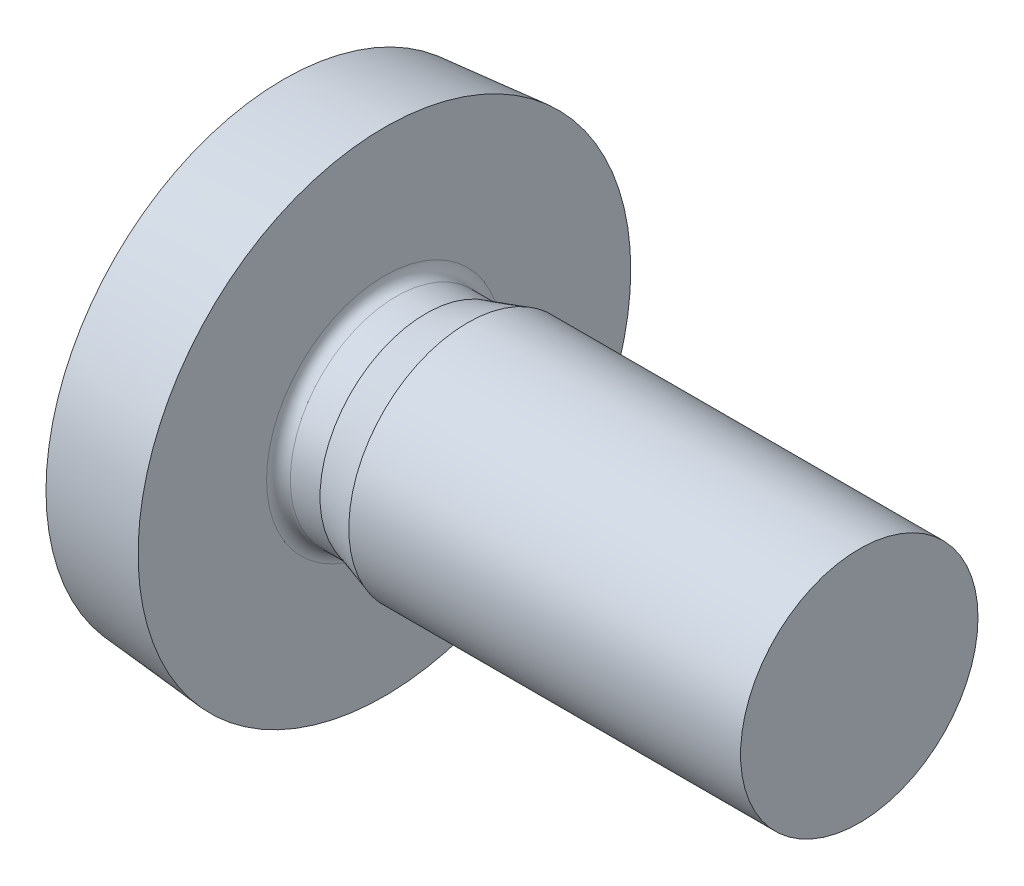
ISO-10303-21;
HEADER;
FILE_DESCRIPTION(('STEP AP214'),'2;1');
FILE_NAME('part.step','',(''),(''),'','','');
FILE_SCHEMA(('AUTOMOTIVE_DESIGN { 1 0 10303 214 1 1 1 1 }'));
ENDSEC;
DATA;
#1=APPLICATION_CONTEXT('core data for automotive mechanical design processes');
#2=APPLICATION_PROTOCOL_DEFINITION('international standard','automotive_design',2000,#1);
#3=PRODUCT_CONTEXT('',#1,'mechanical');
#4=PRODUCT('Part','Part','',(#3));
#5=PRODUCT_RELATED_PRODUCT_CATEGORY('part','',(#4));
#6=PRODUCT_DEFINITION_FORMATION('','',#4);
#7=PRODUCT_DEFINITION_CONTEXT('part definition',#1,'design');
#8=PRODUCT_DEFINITION('design','',#6,#7);
#9=PRODUCT_DEFINITION_SHAPE('','',#8);
#10=(LENGTH_UNIT() NAMED_UNIT(*) SI_UNIT(.MILLI.,.METRE.));
#11=(NAMED_UNIT(*) PLANE_ANGLE_UNIT() SI_UNIT($,.RADIAN.));
#12=(NAMED_UNIT(*) SI_UNIT($,.STERADIAN.) SOLID_ANGLE_UNIT());
#13=UNCERTAINTY_MEASURE_WITH_UNIT(LENGTH_MEASURE(1.E-05),#10,'distance_accuracy_value','');
#14=(GEOMETRIC_REPRESENTATION_CONTEXT(3) GLOBAL_UNCERTAINTY_ASSIGNED_CONTEXT((#13)) GLOBAL_UNIT_ASSIGNED_CONTEXT((#10,
#11,#12)) REPRESENTATION_CONTEXT('',''));
#15=CARTESIAN_POINT('',(0.,0.,0.));
#16=DIRECTION('',(0.,0.,1.));
#17=DIRECTION('',(1.,0.,0.));
#18=AXIS2_PLACEMENT_3D('',#15,#16,#17);
#19=CARTESIAN_POINT('',(8.,0.999999999999991,0.));
#20=DIRECTION('',(1.,0.,0.));
#21=DIRECTION('',(0.,0.,-1.));
#22=AXIS2_PLACEMENT_3D('',#19,#20,#21);
#23=PLANE('',#22);
#24=CARTESIAN_POINT('',(8.,0.,0.));
#25=DIRECTION('',(1.,0.,0.));
#26=DIRECTION('',(0.,0.,-1.));
#27=AXIS2_PLACEMENT_3D('',#24,#25,#26);
#28=CIRCLE('',#27,2.);
#29=CARTESIAN_POINT('',(8.,0.,-2.));
#30=VERTEX_POINT('',#29);
#31=EDGE_CURVE('E187',#30,#30,#28,.F.);
#32=ORIENTED_EDGE('',*,*,#31,.F.);
#33=EDGE_LOOP('',(#32));
#34=FACE_BOUND('',#33,.T.);
#35=ADVANCED_FACE('F17',(#34),#23,.T.);
#36=CARTESIAN_POINT('',(-1.25,0.,0.));
#37=DIRECTION('',(1.,0.,0.));
#38=DIRECTION('',(0.,0.,-1.));
#39=AXIS2_PLACEMENT_3D('',#36,#37,#38);
#40=PLANE('',#39);
#41=CARTESIAN_POINT('',(-1.25,1.38333333333333,1.38333333333332));
#42=DIRECTION('',(-1.,0.,0.));
#43=DIRECTION('',(0.,0.,1.));
#44=AXIS2_PLACEMENT_3D('',#41,#42,#43);
#45=CIRCLE('',#44,0.83);
#46=CARTESIAN_POINT('',(-1.25,1.38333333333333,0.553333333333322));
#47=VERTEX_POINT('',#46);
#48=CARTESIAN_POINT('',(-1.25,0.553333333333333,1.38333333333332));
#49=VERTEX_POINT('',#48);
#50=EDGE_CURVE('E219',#47,#49,#45,.T.);
#51=ORIENTED_EDGE('',*,*,#50,.F.);
#52=DIRECTION('',(0.,-1.,0.));
#53=VECTOR('',#52,1.);
#54=CARTESIAN_POINT('',(-1.25,1.38333333333333,0.553333333333322));
#55=LINE('',#54,#53);
#56=CARTESIAN_POINT('',(-1.25,2.15,0.553333333333322));
#57=VERTEX_POINT('',#56);
#58=EDGE_CURVE('E222',#47,#57,#55,.F.);
#59=ORIENTED_EDGE('',*,*,#58,.T.);
#60=DIRECTION('',(0.,0.,1.));
#61=VECTOR('',#60,1.);
#62=CARTESIAN_POINT('',(-1.25,2.15,0.553333333333322));
#63=LINE('',#62,#61);
#64=CARTESIAN_POINT('',(-1.25,2.15,-0.55333333333335));
#65=VERTEX_POINT('',#64);
#66=EDGE_CURVE('E146',#57,#65,#63,.F.);
#67=ORIENTED_EDGE('',*,*,#66,.T.);
#68=DIRECTION('',(0.,1.,0.));
#69=VECTOR('',#68,1.);
#70=CARTESIAN_POINT('',(-1.25,2.15,-0.55333333333335));
#71=LINE('',#70,#69);
#72=CARTESIAN_POINT('',(-1.25,1.38333333333333,-0.55333333333335));
#73=VERTEX_POINT('',#72);
#74=EDGE_CURVE('E139',#65,#73,#71,.F.);
#75=ORIENTED_EDGE('',*,*,#74,.T.);
#76=CARTESIAN_POINT('',(-1.25,1.38333333333333,-1.38333333333335));
#77=DIRECTION('',(-1.,0.,0.));
#78=DIRECTION('',(0.,0.,1.));
#79=AXIS2_PLACEMENT_3D('',#76,#77,#78);
#80=CIRCLE('',#79,0.83);
#81=CARTESIAN_POINT('',(-1.25,0.553333333333331,-1.38333333333335));
#82=VERTEX_POINT('',#81);
#83=EDGE_CURVE('E143',#82,#73,#80,.T.);
#84=ORIENTED_EDGE('',*,*,#83,.F.);
#85=DIRECTION('',(0.,0.,1.));
#86=VECTOR('',#85,1.);
#87=CARTESIAN_POINT('',(-1.25,0.553333333333333,-1.38333333333335));
#88=LINE('',#87,#86);
#89=CARTESIAN_POINT('',(-1.25,0.553333333333333,-2.15000000000001));
#90=VERTEX_POINT('',#89);
#91=EDGE_CURVE('E134',#82,#90,#88,.F.);
#92=ORIENTED_EDGE('',*,*,#91,.T.);
#93=DIRECTION('',(0.,1.,0.));
#94=VECTOR('',#93,1.);
#95=CARTESIAN_POINT('',(-1.25,0.553333333333333,-2.15000000000001));
#96=LINE('',#95,#94);
#97=CARTESIAN_POINT('',(-1.25,-0.553333333333334,-2.15000000000001));
#98=VERTEX_POINT('',#97);
#99=EDGE_CURVE('E181',#90,#98,#96,.F.);
#100=ORIENTED_EDGE('',*,*,#99,.T.);
#101=DIRECTION('',(0.,0.,-1.));
#102=VECTOR('',#101,1.);
#103=CARTESIAN_POINT('',(-1.25,-0.553333333333334,-2.15000000000001));
#104=LINE('',#103,#102);
#105=CARTESIAN_POINT('',(-1.25,-0.553333333333333,-1.38333333333335));
#106=VERTEX_POINT('',#105);
#107=EDGE_CURVE('E175',#98,#106,#104,.F.);
#108=ORIENTED_EDGE('',*,*,#107,.T.);
#109=CARTESIAN_POINT('',(-1.25,-1.38333333333333,-1.38333333333335));
#110=DIRECTION('',(-1.,0.,0.));
#111=DIRECTION('',(0.,0.,1.));
#112=AXIS2_PLACEMENT_3D('',#109,#110,#111);
#113=CIRCLE('',#112,0.83);
#114=CARTESIAN_POINT('',(-1.25,-1.38333333333333,-0.55333333333335));
#115=VERTEX_POINT('',#114);
#116=EDGE_CURVE('E178',#115,#106,#113,.T.);
#117=ORIENTED_EDGE('',*,*,#116,.F.);
#118=DIRECTION('',(0.,1.,0.));
#119=VECTOR('',#118,1.);
#120=CARTESIAN_POINT('',(-1.25,-1.38333333333333,-0.55333333333335));
#121=LINE('',#120,#119);
#122=CARTESIAN_POINT('',(-1.25,-2.15,-0.55333333333335));
#123=VERTEX_POINT('',#122);
#124=EDGE_CURVE('E190',#115,#123,#121,.F.);
#125=ORIENTED_EDGE('',*,*,#124,.T.);
#126=DIRECTION('',(0.,0.,-1.));
#127=VECTOR('',#126,1.);
#128=CARTESIAN_POINT('',(-1.25,-2.15,-0.55333333333335));
#129=LINE('',#128,#127);
#130=CARTESIAN_POINT('',(-1.25,-2.15,0.553333333333322));
#131=VERTEX_POINT('',#130);
#132=EDGE_CURVE('E196',#123,#131,#129,.F.);
#133=ORIENTED_EDGE('',*,*,#132,.T.);
#134=DIRECTION('',(0.,1.,0.));
#135=VECTOR('',#134,1.);
#136=CARTESIAN_POINT('',(-1.25,-2.15,0.553333333333322));
#137=LINE('',#136,#135);
#138=CARTESIAN_POINT('',(-1.25,-1.38333333333333,0.553333333333322));
#139=VERTEX_POINT('',#138);
#140=EDGE_CURVE('E201',#131,#139,#137,.T.);
#141=ORIENTED_EDGE('',*,*,#140,.T.);
#142=CARTESIAN_POINT('',(-1.25,-1.38333333333333,1.38333333333332));
#143=DIRECTION('',(-1.,0.,0.));
#144=DIRECTION('',(0.,0.,1.));
#145=AXIS2_PLACEMENT_3D('',#142,#143,#144);
#146=CIRCLE('',#145,0.829999999999999);
#147=CARTESIAN_POINT('',(-1.25,-0.553333333333332,1.38333333333332));
#148=VERTEX_POINT('',#147);
#149=EDGE_CURVE('E203',#148,#139,#146,.T.);
#150=ORIENTED_EDGE('',*,*,#149,.F.);
#151=DIRECTION('',(0.,0.,-1.));
#152=VECTOR('',#151,1.);
#153=CARTESIAN_POINT('',(-1.25,-0.553333333333333,1.38333333333332));
#154=LINE('',#153,#152);
#155=CARTESIAN_POINT('',(-1.25,-0.553333333333334,2.15000000000001));
#156=VERTEX_POINT('',#155);
#157=EDGE_CURVE('E206',#148,#156,#154,.F.);
#158=ORIENTED_EDGE('',*,*,#157,.T.);
#159=DIRECTION('',(0.,1.,0.));
#160=VECTOR('',#159,1.);
#161=CARTESIAN_POINT('',(-1.25,-0.553333333333334,2.15000000000001));
#162=LINE('',#161,#160);
#163=CARTESIAN_POINT('',(-1.25,0.553333333333333,2.15000000000001));
#164=VERTEX_POINT('',#163);
#165=EDGE_CURVE('E212',#156,#164,#162,.T.);
#166=ORIENTED_EDGE('',*,*,#165,.T.);
#167=DIRECTION('',(0.,0.,1.));
#168=VECTOR('',#167,1.);
#169=CARTESIAN_POINT('',(-1.25,0.553333333333333,2.15000000000001));
#170=LINE('',#169,#168);
#171=EDGE_CURVE('E217',#164,#49,#170,.F.);
#172=ORIENTED_EDGE('',*,*,#171,.T.);
#173=EDGE_LOOP('',(#51,#59,#67,#75,#84,#92,#100,#108,#117,#125,#133,#141,#150,#158,#166,#172));
#174=FACE_BOUND('',#173,.T.);
#175=ADVANCED_FACE('F142',(#174),#40,.F.);
#176=CARTESIAN_POINT('',(4.7,0.,0.));
#177=DIRECTION('',(1.,0.,0.));
#178=DIRECTION('',(0.,0.,-1.));
#179=AXIS2_PLACEMENT_3D('',#176,#177,#178);
#180=CYLINDRICAL_SURFACE('',#179,2.);
#181=CARTESIAN_POINT('',(1.39999999993279,0.,0.));
#182=DIRECTION('',(1.,0.,0.));
#183=DIRECTION('',(0.,1.,0.));
#184=AXIS2_PLACEMENT_3D('',#181,#182,#183);
#185=CIRCLE('',#184,2.00000000000955);
#186=CARTESIAN_POINT('',(1.39999999993279,2.00000000000955,0.));
#187=VERTEX_POINT('',#186);
#188=EDGE_CURVE('E170',#187,#187,#185,.F.);
#189=ORIENTED_EDGE('',*,*,#188,.F.);
#190=EDGE_LOOP('',(#189));
#191=FACE_BOUND('',#190,.T.);
#192=ORIENTED_EDGE('',*,*,#31,.T.);
#193=EDGE_LOOP('',(#192));
#194=FACE_BOUND('',#193,.T.);
#195=ADVANCED_FACE('F345',(#191,#194),#180,.T.);
#196=CARTESIAN_POINT('',(-2.5,0.553333333333333,-1.38333333333335));
#197=DIRECTION('',(0.,1.,0.));
#198=DIRECTION('',(0.,0.,1.));
#199=AXIS2_PLACEMENT_3D('',#196,#197,#198);
#200=PLANE('',#199);
#201=DIRECTION('',(-1.,0.,0.));
#202=VECTOR('',#201,1.);
#203=CARTESIAN_POINT('',(-2.5,0.553333333333333,-2.15000000000001));
#204=LINE('',#203,#202);
#205=CARTESIAN_POINT('',(-2.26043126464438,0.553333333333333,-2.15000000000001));
#206=VERTEX_POINT('',#205);
#207=EDGE_CURVE('E183',#206,#90,#204,.F.);
#208=ORIENTED_EDGE('',*,*,#207,.T.);
#209=ORIENTED_EDGE('',*,*,#91,.F.);
#210=DIRECTION('',(-1.,0.,0.));
#211=VECTOR('',#210,1.);
#212=CARTESIAN_POINT('',(-2.5,0.55333333333333,-1.38333333333335));
#213=LINE('',#212,#211);
#214=CARTESIAN_POINT('',(-2.39279223948006,0.553333333333331,-1.38333333333335));
#215=VERTEX_POINT('',#214);
#216=EDGE_CURVE('E156',#215,#82,#213,.F.);
#217=ORIENTED_EDGE('',*,*,#216,.F.);
#218=CARTESIAN_POINT('',(-2.2604312646444,0.553333333333332,-2.15000000000001));
#219=CARTESIAN_POINT('',(-2.28727638804803,0.553333333333333,-2.02304832060491));
#220=CARTESIAN_POINT('',(-2.31172903098615,0.553333333333333,-1.89568359201846));
#221=CARTESIAN_POINT('',(-2.35584935593138,0.553333333333333,-1.64012803646291));
#222=CARTESIAN_POINT('',(-2.37551703793848,0.553333333333333,-1.5119372094938));
#223=CARTESIAN_POINT('',(-2.39279223948008,0.553333333333333,-1.38333333333335));
#224=B_SPLINE_CURVE_WITH_KNOTS('',3,(#218,#219,#220,#221,#222,#223),.UNSPECIFIED.,.F.,.F.,(4,2,
4),(0.,0.38907242579116,0.77814485158232),.UNSPECIFIED.);
#225=EDGE_CURVE('E173',#206,#215,#224,.T.);
#226=ORIENTED_EDGE('',*,*,#225,.F.);
#227=EDGE_LOOP('',(#208,#209,#217,#226));
#228=FACE_BOUND('',#227,.T.);
#229=ADVANCED_FACE('F341',(#228),#200,.F.);
#230=CARTESIAN_POINT('',(-2.5,1.38333333333333,-1.38333333333335));
#231=DIRECTION('',(-1.,0.,0.));
#232=DIRECTION('',(0.,0.,1.));
#233=AXIS2_PLACEMENT_3D('',#230,#231,#232);
#234=CYLINDRICAL_SURFACE('',#233,0.83);
#235=ORIENTED_EDGE('',*,*,#83,.T.);
#236=DIRECTION('',(-1.,0.,0.));
#237=VECTOR('',#236,1.);
#238=CARTESIAN_POINT('',(-2.5,1.38333333333333,-0.55333333333335));
#239=LINE('',#238,#237);
#240=CARTESIAN_POINT('',(-2.39279223948006,1.38333333333334,-0.55333333333335));
#241=VERTEX_POINT('',#240);
#242=EDGE_CURVE('E150',#73,#241,#239,.T.);
#243=ORIENTED_EDGE('',*,*,#242,.T.);
#244=CARTESIAN_POINT('',(-2.39279223948008,0.553333333333331,-1.38333333333335));
#245=CARTESIAN_POINT('',(-2.39898834030445,0.553292480330722,-1.3372427121501));
#246=CARTESIAN_POINT('',(-2.40466204736365,0.557170612028293,-1.29108167455963));
#247=CARTESIAN_POINT('',(-2.41482408451151,0.572543948766838,-1.19992611953925));
#248=CARTESIAN_POINT('',(-2.4193127651365,0.584036897771096,-1.15493126070784));
#249=CARTESIAN_POINT('',(-2.42697131300438,0.614432379520711,-1.06734863411586));
#250=CARTESIAN_POINT('',(-2.430140033432,0.633341327903065,-1.02476298718155));
#251=CARTESIAN_POINT('',(-2.43505778086162,0.67804623289172,-0.943303200343081));
#252=CARTESIAN_POINT('',(-2.43680732299513,0.703839686047029,-0.904427718253093));
#253=CARTESIAN_POINT('',(-2.43882481636027,0.761317389648645,-0.831863789290647));
#254=CARTESIAN_POINT('',(-2.43910662025552,0.79294363399412,-0.798129772430184));
#255=CARTESIAN_POINT('',(-2.43821746517838,0.861341026978595,-0.736381760567254));
#256=CARTESIAN_POINT('',(-2.43704653870199,0.898112060517898,-0.708367637633267));
#257=CARTESIAN_POINT('',(-2.43329581682291,0.975568844877012,-0.658950444916461));
#258=CARTESIAN_POINT('',(-2.43072191565835,1.01623763521024,-0.637520299150638));
#259=CARTESIAN_POINT('',(-2.42424486321168,1.10045769587706,-0.601685315967654));
#260=CARTESIAN_POINT('',(-2.42034212768288,1.14400806122094,-0.587278284648077));
#261=CARTESIAN_POINT('',(-2.41258488709044,1.22034023294966,-0.568829182585897));
#262=CARTESIAN_POINT('',(-2.40902071631703,1.25273647757006,-0.563016748020685));
#263=CARTESIAN_POINT('',(-2.40132163417102,1.31787478462519,-0.555268205110744));
#264=CARTESIAN_POINT('',(-2.39718754919539,1.35061628406638,-0.553326545909529));
#265=CARTESIAN_POINT('',(-2.39279223948008,1.38333333333334,-0.55333333333335));
#266=B_SPLINE_CURVE_WITH_KNOTS('',3,(#244,#245,#246,#247,#248,#249,#250,#251,#252,#253,#254,
#255,#256,#257,#258,#259,#260,#261,#262,#263,#264,#265),.UNSPECIFIED.,.F.,.F.,(4,2,2,2,2,2,2,2,
2,2,4),(0.,0.139352064096968,0.278662860903329,0.41809444331915,0.557475392362428,
0.695538434343332,0.83359838805891,0.971082739442436,1.10852411546956,1.2076194925648,
1.30657266015641),.UNSPECIFIED.);
#267=EDGE_CURVE('E317',#215,#241,#266,.T.);
#268=ORIENTED_EDGE('',*,*,#267,.F.);
#269=ORIENTED_EDGE('',*,*,#216,.T.);
#270=EDGE_LOOP('',(#235,#243,#268,#269));
#271=FACE_BOUND('',#270,.T.);
#272=ADVANCED_FACE('F153',(#271),#234,.T.);
#273=CARTESIAN_POINT('',(-2.5,2.15,-0.55333333333335));
#274=DIRECTION('',(0.,0.,-1.));
#275=DIRECTION('',(-1.,0.,0.));
#276=AXIS2_PLACEMENT_3D('',#273,#274,#275);
#277=PLANE('',#276);
#278=ORIENTED_EDGE('',*,*,#242,.F.);
#279=ORIENTED_EDGE('',*,*,#74,.F.);
#280=DIRECTION('',(1.,0.,0.));
#281=VECTOR('',#280,1.);
#282=CARTESIAN_POINT('',(-2.5,2.15,-0.55333333333335));
#283=LINE('',#282,#281);
#284=CARTESIAN_POINT('',(-2.26043126464438,2.15,-0.55333333333335));
#285=VERTEX_POINT('',#284);
#286=EDGE_CURVE('E163',#65,#285,#283,.F.);
#287=ORIENTED_EDGE('',*,*,#286,.T.);
#288=CARTESIAN_POINT('',(-2.39279223948008,1.38333333333334,-0.55333333333335));
#289=CARTESIAN_POINT('',(-2.37551703793848,1.51193720949379,-0.55333333333335));
#290=CARTESIAN_POINT('',(-2.35584935593138,1.6401280364629,-0.55333333333335));
#291=CARTESIAN_POINT('',(-2.31172903098615,1.89568359201846,-0.55333333333335));
#292=CARTESIAN_POINT('',(-2.28727638804803,2.0230483206049,-0.55333333333335));
#293=CARTESIAN_POINT('',(-2.26043126464439,2.15000000000001,-0.55333333333335));
#294=B_SPLINE_CURVE_WITH_KNOTS('',3,(#288,#289,#290,#291,#292,#293),.UNSPECIFIED.,.F.,.F.,(4,2,
4),(0.,0.389072425791161,0.778144851582322),.UNSPECIFIED.);
#295=EDGE_CURVE('E160',#241,#285,#294,.T.);
#296=ORIENTED_EDGE('',*,*,#295,.F.);
#297=EDGE_LOOP('',(#278,#279,#287,#296));
#298=FACE_BOUND('',#297,.T.);
#299=ADVANCED_FACE('F158',(#298),#277,.F.);
#300=CARTESIAN_POINT('',(-2.5,2.15,0.553333333333322));
#301=DIRECTION('',(0.,1.,0.));
#302=DIRECTION('',(0.,0.,1.));
#303=AXIS2_PLACEMENT_3D('',#300,#301,#302);
#304=PLANE('',#303);
#305=ORIENTED_EDGE('',*,*,#286,.F.);
#306=ORIENTED_EDGE('',*,*,#66,.F.);
#307=DIRECTION('',(1.,0.,0.));
#308=VECTOR('',#307,1.);
#309=CARTESIAN_POINT('',(-2.5,2.15,0.553333333333322));
#310=LINE('',#309,#308);
#311=CARTESIAN_POINT('',(-2.26043126464438,2.15,0.553333333333322));
#312=VERTEX_POINT('',#311);
#313=EDGE_CURVE('E224',#57,#312,#310,.F.);
#314=ORIENTED_EDGE('',*,*,#313,.T.);
#315=CARTESIAN_POINT('',(-2.2604312646444,2.15,-0.55333333333335));
#316=CARTESIAN_POINT('',(-2.27046234685805,2.15,-0.368888888888905));
#317=CARTESIAN_POINT('',(-2.27547788796488,2.15,-0.184444444444459));
#318=CARTESIAN_POINT('',(-2.27547788796489,2.15,0.184444444444432));
#319=CARTESIAN_POINT('',(-2.27046234685806,2.15,0.368888888888877));
#320=CARTESIAN_POINT('',(-2.2604312646444,2.15,0.553333333333322));
#321=B_SPLINE_CURVE_WITH_KNOTS('',3,(#315,#316,#317,#318,#319,#320),.UNSPECIFIED.,.F.,.F.,(4,2,
4),(0.,0.553537874631113,1.10707574926223),.UNSPECIFIED.);
#322=EDGE_CURVE('E307',#285,#312,#321,.T.);
#323=ORIENTED_EDGE('',*,*,#322,.F.);
#324=EDGE_LOOP('',(#305,#306,#314,#323));
#325=FACE_BOUND('',#324,.T.);
#326=ADVANCED_FACE('F308',(#325),#304,.F.);
#327=CARTESIAN_POINT('',(-2.5,1.38333333333333,0.553333333333322));
#328=DIRECTION('',(0.,0.,1.));
#329=DIRECTION('',(0.,-1.,0.));
#330=AXIS2_PLACEMENT_3D('',#327,#328,#329);
#331=PLANE('',#330);
#332=ORIENTED_EDGE('',*,*,#313,.F.);
#333=ORIENTED_EDGE('',*,*,#58,.F.);
#334=DIRECTION('',(-1.,0.,0.));
#335=VECTOR('',#334,1.);
#336=CARTESIAN_POINT('',(-2.5,1.38333333333333,0.553333333333322));
#337=LINE('',#336,#335);
#338=CARTESIAN_POINT('',(-2.39279223948006,1.38333333333333,0.553333333333322));
#339=VERTEX_POINT('',#338);
#340=EDGE_CURVE('E299',#339,#47,#337,.F.);
#341=ORIENTED_EDGE('',*,*,#340,.F.);
#342=CARTESIAN_POINT('',(-2.2604312646444,2.15,0.553333333333322));
#343=CARTESIAN_POINT('',(-2.28727638804803,2.0230483206049,0.553333333333323));
#344=CARTESIAN_POINT('',(-2.31172903098615,1.89568359201845,0.553333333333323));
#345=CARTESIAN_POINT('',(-2.35584935593138,1.6401280364629,0.553333333333323));
#346=CARTESIAN_POINT('',(-2.37551703793849,1.51193720949378,0.553333333333323));
#347=CARTESIAN_POINT('',(-2.39279223948008,1.38333333333334,0.553333333333322));
#348=B_SPLINE_CURVE_WITH_KNOTS('',3,(#342,#343,#344,#345,#346,#347),.UNSPECIFIED.,.F.,.F.,(4,2,
4),(0.,0.389072425791162,0.778144851582324),.UNSPECIFIED.);
#349=EDGE_CURVE('E312',#312,#339,#348,.T.);
#350=ORIENTED_EDGE('',*,*,#349,.F.);
#351=EDGE_LOOP('',(#332,#333,#341,#350));
#352=FACE_BOUND('',#351,.T.);
#353=ADVANCED_FACE('F473',(#352),#331,.F.);
#354=CARTESIAN_POINT('',(-2.5,1.38333333333333,1.38333333333332));
#355=DIRECTION('',(-1.,0.,0.));
#356=DIRECTION('',(0.,0.,1.));
#357=AXIS2_PLACEMENT_3D('',#354,#355,#356);
#358=CYLINDRICAL_SURFACE('',#357,0.83);
#359=ORIENTED_EDGE('',*,*,#50,.T.);
#360=DIRECTION('',(1.,0.,0.));
#361=VECTOR('',#360,1.);
#362=CARTESIAN_POINT('',(-2.5,0.553333333333333,1.38333333333332));
#363=LINE('',#362,#361);
#364=CARTESIAN_POINT('',(-2.39279223948006,0.553333333333333,1.38333333333332));
#365=VERTEX_POINT('',#364);
#366=EDGE_CURVE('E214',#49,#365,#363,.F.);
#367=ORIENTED_EDGE('',*,*,#366,.T.);
#368=CARTESIAN_POINT('',(-2.39279223948008,1.38333333333334,0.553333333333322));
#369=CARTESIAN_POINT('',(-2.39898834030444,1.33724271215009,0.55329248033071));
#370=CARTESIAN_POINT('',(-2.40466204736364,1.29108167455961,0.557170612028282));
#371=CARTESIAN_POINT('',(-2.41482408451151,1.19992611953923,0.572543948766829));
#372=CARTESIAN_POINT('',(-2.4193127651365,1.15493126070782,0.584036897771089));
#373=CARTESIAN_POINT('',(-2.42697131300438,1.06734863411584,0.614432379520702));
#374=CARTESIAN_POINT('',(-2.430140033432,1.02476298718153,0.633341327903052));
#375=CARTESIAN_POINT('',(-2.43505778086161,0.943303200343068,0.678046232891714));
#376=CARTESIAN_POINT('',(-2.43680732299513,0.90442771825309,0.703839686047034));
#377=CARTESIAN_POINT('',(-2.43882481636027,0.831863789290642,0.761317389648647));
#378=CARTESIAN_POINT('',(-2.43910662025552,0.798129772430168,0.792943633994109));
#379=CARTESIAN_POINT('',(-2.43821746517837,0.736381760567242,0.86134102697858));
#380=CARTESIAN_POINT('',(-2.43704653870199,0.708367637633269,0.898112060517891));
#381=CARTESIAN_POINT('',(-2.43329581682291,0.658950444916462,0.97556884487701));
#382=CARTESIAN_POINT('',(-2.43072191565835,0.637520299150626,1.01623763521023));
#383=CARTESIAN_POINT('',(-2.42424486321168,0.601685315967629,1.10045769587706));
#384=CARTESIAN_POINT('',(-2.42034212768288,0.587278284648054,1.14400806122094));
#385=CARTESIAN_POINT('',(-2.41258488709044,0.568829182585876,1.22034023294966));
#386=CARTESIAN_POINT('',(-2.40902071631703,0.563016748020665,1.25273647757006));
#387=CARTESIAN_POINT('',(-2.40132163417102,0.555268205110726,1.31787478462519));
#388=CARTESIAN_POINT('',(-2.39718754919539,0.55332654590951,1.35061628406639));
#389=CARTESIAN_POINT('',(-2.39279223948008,0.55333333333333,1.38333333333335));
#390=B_SPLINE_CURVE_WITH_KNOTS('',3,(#368,#369,#370,#371,#372,#373,#374,#375,#376,#377,#378,
#379,#380,#381,#382,#383,#384,#385,#386,#387,#388,#389),.UNSPECIFIED.,.F.,.F.,(4,2,2,2,2,2,2,2,
2,2,4),(0.,0.139352064096973,0.278662860903338,0.418094443319155,0.557475392362429,
0.695538434343329,0.833598388058903,0.971082739442437,1.10852411546957,1.20761949256481,
1.30657266015643),.UNSPECIFIED.);
#391=EDGE_CURVE('E687',#339,#365,#390,.T.);
#392=ORIENTED_EDGE('',*,*,#391,.F.);
#393=ORIENTED_EDGE('',*,*,#340,.T.);
#394=EDGE_LOOP('',(#359,#367,#392,#393));
#395=FACE_BOUND('',#394,.T.);
#396=ADVANCED_FACE('F479',(#395),#358,.T.);
#397=CARTESIAN_POINT('',(-2.5,0.553333333333333,2.15000000000001));
#398=DIRECTION('',(0.,1.,0.));
#399=DIRECTION('',(0.,0.,1.));
#400=AXIS2_PLACEMENT_3D('',#397,#398,#399);
#401=PLANE('',#400);
#402=ORIENTED_EDGE('',*,*,#366,.F.);
#403=ORIENTED_EDGE('',*,*,#171,.F.);
#404=DIRECTION('',(1.,0.,0.));
#405=VECTOR('',#404,1.);
#406=CARTESIAN_POINT('',(-2.5,0.553333333333333,2.15000000000001));
#407=LINE('',#406,#405);
#408=CARTESIAN_POINT('',(-2.26043126464438,0.553333333333334,2.15000000000001));
#409=VERTEX_POINT('',#408);
#410=EDGE_CURVE('E209',#164,#409,#407,.F.);
#411=ORIENTED_EDGE('',*,*,#410,.T.);
#412=CARTESIAN_POINT('',(-2.39279223948008,0.553333333333333,1.38333333333335));
#413=CARTESIAN_POINT('',(-2.37551703793849,0.553333333333333,1.5119372094938));
#414=CARTESIAN_POINT('',(-2.35584935593138,0.553333333333333,1.64012803646291));
#415=CARTESIAN_POINT('',(-2.31172903098615,0.553333333333333,1.89568359201846));
#416=CARTESIAN_POINT('',(-2.28727638804803,0.553333333333333,2.02304832060491));
#417=CARTESIAN_POINT('',(-2.2604312646444,0.553333333333334,2.15000000000001));
#418=B_SPLINE_CURVE_WITH_KNOTS('',3,(#412,#413,#414,#415,#416,#417),.UNSPECIFIED.,.F.,.F.,(4,2,
4),(0.,0.38907242579116,0.778144851582321),.UNSPECIFIED.);
#419=EDGE_CURVE('E684',#365,#409,#418,.T.);
#420=ORIENTED_EDGE('',*,*,#419,.F.);
#421=EDGE_LOOP('',(#402,#403,#411,#420));
#422=FACE_BOUND('',#421,.T.);
#423=ADVANCED_FACE('F486',(#422),#401,.F.);
#424=CARTESIAN_POINT('',(-2.5,-0.553333333333333,2.15000000000001));
#425=DIRECTION('',(0.,0.,1.));
#426=DIRECTION('',(1.,0.,0.));
#427=AXIS2_PLACEMENT_3D('',#424,#425,#426);
#428=PLANE('',#427);
#429=ORIENTED_EDGE('',*,*,#410,.F.);
#430=ORIENTED_EDGE('',*,*,#165,.F.);
#431=DIRECTION('',(1.,0.,0.));
#432=VECTOR('',#431,1.);
#433=CARTESIAN_POINT('',(-2.5,-0.553333333333333,2.15000000000001));
#434=LINE('',#433,#432);
#435=CARTESIAN_POINT('',(-2.26043126464438,-0.553333333333333,2.15000000000001));
#436=VERTEX_POINT('',#435);
#437=EDGE_CURVE('E208',#156,#436,#434,.F.);
#438=ORIENTED_EDGE('',*,*,#437,.T.);
#439=CARTESIAN_POINT('',(-2.2604312646444,0.553333333333334,2.14999999999999));
#440=CARTESIAN_POINT('',(-2.27046234685806,0.36888888888889,2.15));
#441=CARTESIAN_POINT('',(-2.27547788796489,0.184444444444445,2.15000000000001));
#442=CARTESIAN_POINT('',(-2.27547788796489,-0.184444444444444,2.15000000000001));
#443=CARTESIAN_POINT('',(-2.27046234685806,-0.368888888888889,2.15));
#444=CARTESIAN_POINT('',(-2.2604312646444,-0.553333333333334,2.14999999999999));
#445=B_SPLINE_CURVE_WITH_KNOTS('',3,(#439,#440,#441,#442,#443,#444),.UNSPECIFIED.,.F.,.F.,(4,2,
4),(0.,0.55353787463111,1.10707574926222),.UNSPECIFIED.);
#446=EDGE_CURVE('E681',#409,#436,#445,.T.);
#447=ORIENTED_EDGE('',*,*,#446,.F.);
#448=EDGE_LOOP('',(#429,#430,#438,#447));
#449=FACE_BOUND('',#448,.T.);
#450=ADVANCED_FACE('F494',(#449),#428,.F.);
#451=CARTESIAN_POINT('',(-2.5,-0.553333333333333,1.38333333333332));
#452=DIRECTION('',(0.,-1.,0.));
#453=DIRECTION('',(0.,0.,-1.));
#454=AXIS2_PLACEMENT_3D('',#451,#452,#453);
#455=PLANE('',#454);
#456=ORIENTED_EDGE('',*,*,#437,.F.);
#457=ORIENTED_EDGE('',*,*,#157,.F.);
#458=DIRECTION('',(-1.,0.,0.));
#459=VECTOR('',#458,1.);
#460=CARTESIAN_POINT('',(-2.5,-0.553333333333331,1.38333333333332));
#461=LINE('',#460,#459);
#462=CARTESIAN_POINT('',(-2.39279223948006,-0.553333333333331,1.38333333333332));
#463=VERTEX_POINT('',#462);
#464=EDGE_CURVE('E288',#463,#148,#461,.F.);
#465=ORIENTED_EDGE('',*,*,#464,.F.);
#466=CARTESIAN_POINT('',(-2.2604312646444,-0.553333333333333,2.15000000000001));
#467=CARTESIAN_POINT('',(-2.28727638804803,-0.553333333333333,2.02304832060491));
#468=CARTESIAN_POINT('',(-2.31172903098615,-0.553333333333332,1.89568359201846));
#469=CARTESIAN_POINT('',(-2.35584935593138,-0.553333333333332,1.64012803646291));
#470=CARTESIAN_POINT('',(-2.37551703793849,-0.553333333333333,1.5119372094938));
#471=CARTESIAN_POINT('',(-2.39279223948008,-0.553333333333333,1.38333333333335));
#472=B_SPLINE_CURVE_WITH_KNOTS('',3,(#466,#467,#468,#469,#470,#471),.UNSPECIFIED.,.F.,.F.,(4,2,
4),(0.,0.38907242579116,0.778144851582321),.UNSPECIFIED.);
#473=EDGE_CURVE('E676',#436,#463,#472,.T.);
#474=ORIENTED_EDGE('',*,*,#473,.F.);
#475=EDGE_LOOP('',(#456,#457,#465,#474));
#476=FACE_BOUND('',#475,.T.);
#477=ADVANCED_FACE('F502',(#476),#455,.F.);
#478=CARTESIAN_POINT('',(-2.5,-1.38333333333333,1.38333333333332));
#479=DIRECTION('',(-1.,0.,0.));
#480=DIRECTION('',(0.,0.,1.));
#481=AXIS2_PLACEMENT_3D('',#478,#479,#480);
#482=CYLINDRICAL_SURFACE('',#481,0.829999999999999);
#483=ORIENTED_EDGE('',*,*,#149,.T.);
#484=DIRECTION('',(1.,0.,0.));
#485=VECTOR('',#484,1.);
#486=CARTESIAN_POINT('',(-2.5,-1.38333333333333,0.553333333333322));
#487=LINE('',#486,#485);
#488=CARTESIAN_POINT('',(-2.39279223948006,-1.38333333333333,0.553333333333322));
#489=VERTEX_POINT('',#488);
#490=EDGE_CURVE('E198',#139,#489,#487,.F.);
#491=ORIENTED_EDGE('',*,*,#490,.T.);
#492=CARTESIAN_POINT('',(-2.39279223948008,-0.553333333333331,1.38333333333335));
#493=CARTESIAN_POINT('',(-2.39898834030445,-0.55329248033072,1.3372427121501));
#494=CARTESIAN_POINT('',(-2.40466204736364,-0.557170612028292,1.29108167455962));
#495=CARTESIAN_POINT('',(-2.41482408451151,-0.572543948766838,1.19992611953923));
#496=CARTESIAN_POINT('',(-2.4193127651365,-0.584036897771097,1.15493126070782));
#497=CARTESIAN_POINT('',(-2.42697131300438,-0.61443237952071,1.06734863411583));
#498=CARTESIAN_POINT('',(-2.430140033432,-0.63334132790306,1.02476298718153));
#499=CARTESIAN_POINT('',(-2.43505778086162,-0.678046232891717,0.94330320034307));
#500=CARTESIAN_POINT('',(-2.43680732299513,-0.703839686047034,0.904427718253093));
#501=CARTESIAN_POINT('',(-2.43882481636027,-0.761317389648644,0.831863789290644));
#502=CARTESIAN_POINT('',(-2.43910662025552,-0.792943633994108,0.798129772430169));
#503=CARTESIAN_POINT('',(-2.43821746517837,-0.861341026978583,0.736381760567241));
#504=CARTESIAN_POINT('',(-2.43704653870199,-0.898112060517898,0.708367637633268));
#505=CARTESIAN_POINT('',(-2.43329581682291,-0.975568844877017,0.65895044491646));
#506=CARTESIAN_POINT('',(-2.43072191565835,-1.01623763521023,0.637520299150621));
#507=CARTESIAN_POINT('',(-2.42424486321168,-1.10045769587706,0.601685315967623));
#508=CARTESIAN_POINT('',(-2.42034212768288,-1.14400806122094,0.587278284648048));
#509=CARTESIAN_POINT('',(-2.41258488709044,-1.22034023294965,0.56882918258587));
#510=CARTESIAN_POINT('',(-2.40902071631704,-1.25273647757005,0.563016748020659));
#511=CARTESIAN_POINT('',(-2.40132163417103,-1.31787478462518,0.555268205110718));
#512=CARTESIAN_POINT('',(-2.3971875491954,-1.35061628406638,0.553326545909502));
#513=CARTESIAN_POINT('',(-2.39279223948008,-1.38333333333334,0.553333333333322));
#514=B_SPLINE_CURVE_WITH_KNOTS('',3,(#492,#493,#494,#495,#496,#497,#498,#499,#500,#501,#502,
#503,#504,#505,#506,#507,#508,#509,#510,#511,#512,#513),.UNSPECIFIED.,.F.,.F.,(4,2,2,2,2,2,2,2,
2,2,4),(0.,0.139352064096982,0.278662860903357,0.418094443319166,0.557475392362432,
0.695538434343338,0.833598388058919,0.971082739442449,1.10852411546957,1.20761949256481,
1.30657266015643),.UNSPECIFIED.);
#515=EDGE_CURVE('E672',#463,#489,#514,.T.);
#516=ORIENTED_EDGE('',*,*,#515,.F.);
#517=ORIENTED_EDGE('',*,*,#464,.T.);
#518=EDGE_LOOP('',(#483,#491,#516,#517));
#519=FACE_BOUND('',#518,.T.);
#520=ADVANCED_FACE('F510',(#519),#482,.T.);
#521=CARTESIAN_POINT('',(-2.5,-2.15,0.553333333333322));
#522=DIRECTION('',(0.,0.,1.));
#523=DIRECTION('',(1.,0.,0.));
#524=AXIS2_PLACEMENT_3D('',#521,#522,#523);
#525=PLANE('',#524);
#526=ORIENTED_EDGE('',*,*,#490,.F.);
#527=ORIENTED_EDGE('',*,*,#140,.F.);
#528=DIRECTION('',(1.,0.,0.));
#529=VECTOR('',#528,1.);
#530=CARTESIAN_POINT('',(-2.5,-2.15,0.553333333333322));
#531=LINE('',#530,#529);
#532=CARTESIAN_POINT('',(-2.26043126464438,-2.15,0.553333333333322));
#533=VERTEX_POINT('',#532);
#534=EDGE_CURVE('E193',#131,#533,#531,.F.);
#535=ORIENTED_EDGE('',*,*,#534,.T.);
#536=CARTESIAN_POINT('',(-2.39279223948008,-1.38333333333333,0.553333333333322));
#537=CARTESIAN_POINT('',(-2.37551703793849,-1.51193720949378,0.553333333333322));
#538=CARTESIAN_POINT('',(-2.35584935593139,-1.6401280364629,0.553333333333323));
#539=CARTESIAN_POINT('',(-2.31172903098616,-1.89568359201845,0.553333333333323));
#540=CARTESIAN_POINT('',(-2.28727638804803,-2.02304832060489,0.553333333333322));
#541=CARTESIAN_POINT('',(-2.2604312646444,-2.15,0.553333333333322));
#542=B_SPLINE_CURVE_WITH_KNOTS('',3,(#536,#537,#538,#539,#540,#541),.UNSPECIFIED.,.F.,.F.,(4,2,
4),(0.,0.389072425791162,0.778144851582324),.UNSPECIFIED.);
#543=EDGE_CURVE('E668',#489,#533,#542,.T.);
#544=ORIENTED_EDGE('',*,*,#543,.F.);
#545=EDGE_LOOP('',(#526,#527,#535,#544));
#546=FACE_BOUND('',#545,.T.);
#547=ADVANCED_FACE('F518',(#546),#525,.F.);
#548=CARTESIAN_POINT('',(-2.5,-2.15,-0.55333333333335));
#549=DIRECTION('',(0.,-1.,0.));
#550=DIRECTION('',(0.,0.,-1.));
#551=AXIS2_PLACEMENT_3D('',#548,#549,#550);
#552=PLANE('',#551);
#553=ORIENTED_EDGE('',*,*,#534,.F.);
#554=ORIENTED_EDGE('',*,*,#132,.F.);
#555=DIRECTION('',(-1.,0.,0.));
#556=VECTOR('',#555,1.);
#557=CARTESIAN_POINT('',(-2.5,-2.15,-0.55333333333335));
#558=LINE('',#557,#556);
#559=CARTESIAN_POINT('',(-2.26043126464438,-2.15,-0.55333333333335));
#560=VERTEX_POINT('',#559);
#561=EDGE_CURVE('E192',#123,#560,#558,.T.);
#562=ORIENTED_EDGE('',*,*,#561,.T.);
#563=CARTESIAN_POINT('',(-2.2604312646444,-2.15,0.553333333333322));
#564=CARTESIAN_POINT('',(-2.27046234685806,-2.15,0.368888888888877));
#565=CARTESIAN_POINT('',(-2.27547788796489,-2.15,0.184444444444432));
#566=CARTESIAN_POINT('',(-2.27547788796489,-2.15,-0.184444444444459));
#567=CARTESIAN_POINT('',(-2.27046234685806,-2.15,-0.368888888888905));
#568=CARTESIAN_POINT('',(-2.2604312646444,-2.15,-0.55333333333335));
#569=B_SPLINE_CURVE_WITH_KNOTS('',3,(#563,#564,#565,#566,#567,#568),.UNSPECIFIED.,.F.,.F.,(4,2,
4),(0.,0.553537874631113,1.10707574926223),.UNSPECIFIED.);
#570=EDGE_CURVE('E664',#533,#560,#569,.T.);
#571=ORIENTED_EDGE('',*,*,#570,.F.);
#572=EDGE_LOOP('',(#553,#554,#562,#571));
#573=FACE_BOUND('',#572,.T.);
#574=ADVANCED_FACE('F526',(#573),#552,.F.);
#575=CARTESIAN_POINT('',(-2.5,-1.38333333333333,-0.55333333333335));
#576=DIRECTION('',(0.,0.,-1.));
#577=DIRECTION('',(-1.,0.,0.));
#578=AXIS2_PLACEMENT_3D('',#575,#576,#577);
#579=PLANE('',#578);
#580=ORIENTED_EDGE('',*,*,#561,.F.);
#581=ORIENTED_EDGE('',*,*,#124,.F.);
#582=DIRECTION('',(-1.,0.,0.));
#583=VECTOR('',#582,1.);
#584=CARTESIAN_POINT('',(-2.5,-1.38333333333333,-0.55333333333335));
#585=LINE('',#584,#583);
#586=CARTESIAN_POINT('',(-2.39279223948006,-1.38333333333333,-0.55333333333335));
#587=VERTEX_POINT('',#586);
#588=EDGE_CURVE('E278',#587,#115,#585,.F.);
#589=ORIENTED_EDGE('',*,*,#588,.F.);
#590=CARTESIAN_POINT('',(-2.26043126464439,-2.15000000000001,-0.55333333333335));
#591=CARTESIAN_POINT('',(-2.28727638804803,-2.0230483206049,-0.55333333333335));
#592=CARTESIAN_POINT('',(-2.31172903098616,-1.89568359201845,-0.55333333333335));
#593=CARTESIAN_POINT('',(-2.35584935593138,-1.6401280364629,-0.55333333333335));
#594=CARTESIAN_POINT('',(-2.37551703793849,-1.51193720949378,-0.55333333333335));
#595=CARTESIAN_POINT('',(-2.39279223948008,-1.38333333333333,-0.55333333333335));
#596=B_SPLINE_CURVE_WITH_KNOTS('',3,(#590,#591,#592,#593,#594,#595),.UNSPECIFIED.,.F.,.F.,(4,2,
4),(0.,0.389072425791164,0.778144851582328),.UNSPECIFIED.);
#597=EDGE_CURVE('E658',#560,#587,#596,.T.);
#598=ORIENTED_EDGE('',*,*,#597,.F.);
#599=EDGE_LOOP('',(#580,#581,#589,#598));
#600=FACE_BOUND('',#599,.T.);
#601=ADVANCED_FACE('F534',(#600),#579,.F.);
#602=CARTESIAN_POINT('',(-2.5,-1.38333333333333,-1.38333333333335));
#603=DIRECTION('',(-1.,0.,0.));
#604=DIRECTION('',(0.,0.,1.));
#605=AXIS2_PLACEMENT_3D('',#602,#603,#604);
#606=CYLINDRICAL_SURFACE('',#605,0.83);
#607=ORIENTED_EDGE('',*,*,#116,.T.);
#608=DIRECTION('',(1.,0.,0.));
#609=VECTOR('',#608,1.);
#610=CARTESIAN_POINT('',(-2.5,-0.553333333333325,-1.38333333333335));
#611=LINE('',#610,#609);
#612=CARTESIAN_POINT('',(-2.39279223948006,-0.553333333333325,-1.38333333333335));
#613=VERTEX_POINT('',#612);
#614=EDGE_CURVE('E177',#106,#613,#611,.F.);
#615=ORIENTED_EDGE('',*,*,#614,.T.);
#616=CARTESIAN_POINT('',(-2.39279223948008,-1.38333333333334,-0.55333333333335));
#617=CARTESIAN_POINT('',(-2.39898834030445,-1.33724271215009,-0.553292480330738));
#618=CARTESIAN_POINT('',(-2.40466204736365,-1.29108167455962,-0.557170612028309));
#619=CARTESIAN_POINT('',(-2.41482408451151,-1.19992611953923,-0.572543948766855));
#620=CARTESIAN_POINT('',(-2.4193127651365,-1.15493126070782,-0.584036897771115));
#621=CARTESIAN_POINT('',(-2.42697131300438,-1.06734863411584,-0.61443237952073));
#622=CARTESIAN_POINT('',(-2.430140033432,-1.02476298718154,-0.633341327903082));
#623=CARTESIAN_POINT('',(-2.43505778086162,-0.943303200343072,-0.678046232891731));
#624=CARTESIAN_POINT('',(-2.43680732299513,-0.904427718253088,-0.703839686047037));
#625=CARTESIAN_POINT('',(-2.43882481636027,-0.831863789290641,-0.761317389648648));
#626=CARTESIAN_POINT('',(-2.43910662025552,-0.798129772430174,-0.792943633994122));
#627=CARTESIAN_POINT('',(-2.43821746517837,-0.736381760567249,-0.861341026978605));
#628=CARTESIAN_POINT('',(-2.43704653870199,-0.70836763763327,-0.898112060517917));
#629=CARTESIAN_POINT('',(-2.43329581682291,-0.658950444916463,-0.975568844877033));
#630=CARTESIAN_POINT('',(-2.43072191565835,-0.63752029915063,-1.01623763521025));
#631=CARTESIAN_POINT('',(-2.42424486321168,-0.601685315967632,-1.10045769587707));
#632=CARTESIAN_POINT('',(-2.42034212768288,-0.587278284648051,-1.14400806122094));
#633=CARTESIAN_POINT('',(-2.41258488709044,-0.568829182585874,-1.22034023294966));
#634=CARTESIAN_POINT('',(-2.40902071631703,-0.563016748020666,-1.25273647757006));
#635=CARTESIAN_POINT('',(-2.40132163417102,-0.555268205110728,-1.31787478462519));
#636=CARTESIAN_POINT('',(-2.39718754919539,-0.553326545909511,-1.35061628406639));
#637=CARTESIAN_POINT('',(-2.39279223948008,-0.553333333333321,-1.38333333333335));
#638=B_SPLINE_CURVE_WITH_KNOTS('',3,(#616,#617,#618,#619,#620,#621,#622,#623,#624,#625,#626,
#627,#628,#629,#630,#631,#632,#633,#634,#635,#636,#637),.UNSPECIFIED.,.F.,.F.,(4,2,2,2,2,2,2,2,
2,2,4),(0.,0.13935206409697,0.278662860903338,0.418094443319149,0.557475392362414,
0.695538434343322,0.833598388058907,0.97108273944243,1.10852411546954,1.20761949256479,
1.30657266015641),.UNSPECIFIED.);
#639=EDGE_CURVE('E654',#587,#613,#638,.T.);
#640=ORIENTED_EDGE('',*,*,#639,.F.);
#641=ORIENTED_EDGE('',*,*,#588,.T.);
#642=EDGE_LOOP('',(#607,#615,#640,#641));
#643=FACE_BOUND('',#642,.T.);
#644=ADVANCED_FACE('F542',(#643),#606,.T.);
#645=CARTESIAN_POINT('',(-2.5,-0.553333333333334,-2.15000000000001));
#646=DIRECTION('',(0.,-1.,0.));
#647=DIRECTION('',(0.,0.,-1.));
#648=AXIS2_PLACEMENT_3D('',#645,#646,#647);
#649=PLANE('',#648);
#650=ORIENTED_EDGE('',*,*,#614,.F.);
#651=ORIENTED_EDGE('',*,*,#107,.F.);
#652=DIRECTION('',(-1.,0.,0.));
#653=VECTOR('',#652,1.);
#654=CARTESIAN_POINT('',(-2.5,-0.553333333333334,-2.15000000000001));
#655=LINE('',#654,#653);
#656=CARTESIAN_POINT('',(-2.26043126464438,-0.553333333333334,-2.14999999999999));
#657=VERTEX_POINT('',#656);
#658=EDGE_CURVE('E174',#98,#657,#655,.T.);
#659=ORIENTED_EDGE('',*,*,#658,.T.);
#660=CARTESIAN_POINT('',(-2.39279223948008,-0.553333333333326,-1.38333333333335));
#661=CARTESIAN_POINT('',(-2.37551703793849,-0.553333333333329,-1.5119372094938));
#662=CARTESIAN_POINT('',(-2.35584935593138,-0.553333333333332,-1.64012803646291));
#663=CARTESIAN_POINT('',(-2.31172903098615,-0.553333333333335,-1.89568359201846));
#664=CARTESIAN_POINT('',(-2.28727638804803,-0.553333333333335,-2.02304832060491));
#665=CARTESIAN_POINT('',(-2.2604312646444,-0.553333333333334,-2.15000000000001));
#666=B_SPLINE_CURVE_WITH_KNOTS('',3,(#660,#661,#662,#663,#664,#665),.UNSPECIFIED.,.F.,.F.,(4,2,
4),(0.,0.38907242579116,0.778144851582321),.UNSPECIFIED.);
#667=EDGE_CURVE('E244',#613,#657,#666,.T.);
#668=ORIENTED_EDGE('',*,*,#667,.F.);
#669=EDGE_LOOP('',(#650,#651,#659,#668));
#670=FACE_BOUND('',#669,.T.);
#671=ADVANCED_FACE('F550',(#670),#649,.F.);
#672=CARTESIAN_POINT('',(-2.5,0.553333333333333,-2.15000000000001));
#673=DIRECTION('',(0.,0.,-1.));
#674=DIRECTION('',(-1.,0.,0.));
#675=AXIS2_PLACEMENT_3D('',#672,#673,#674);
#676=PLANE('',#675);
#677=ORIENTED_EDGE('',*,*,#658,.F.);
#678=ORIENTED_EDGE('',*,*,#99,.F.);
#679=ORIENTED_EDGE('',*,*,#207,.F.);
#680=CARTESIAN_POINT('',(-2.2604312646444,-0.553333333333334,-2.14999999999999));
#681=CARTESIAN_POINT('',(-2.27046234685806,-0.368888888888888,-2.14999999999999));
#682=CARTESIAN_POINT('',(-2.27547788796489,-0.184444444444443,-2.14999999999999));
#683=CARTESIAN_POINT('',(-2.27547788796489,0.184444444444447,-2.14999999999999));
#684=CARTESIAN_POINT('',(-2.27046234685806,0.36888888888889,-2.14999999999999));
#685=CARTESIAN_POINT('',(-2.2604312646444,0.553333333333334,-2.14999999999999));
#686=B_SPLINE_CURVE_WITH_KNOTS('',3,(#680,#681,#682,#683,#684,#685),.UNSPECIFIED.,.F.,.F.,(4,2,
4),(0.,0.553537874631115,1.10707574926222),.UNSPECIFIED.);
#687=EDGE_CURVE('E236',#657,#206,#686,.T.);
#688=ORIENTED_EDGE('',*,*,#687,.F.);
#689=EDGE_LOOP('',(#677,#678,#679,#688));
#690=FACE_BOUND('',#689,.T.);
#691=ADVANCED_FACE('F250',(#690),#676,.F.);
#692=CARTESIAN_POINT('',(1.39999999970541,0.,0.));
#693=DIRECTION('',(1.,0.,0.));
#694=DIRECTION('',(0.,0.,-1.));
#695=AXIS2_PLACEMENT_3D('',#692,#693,#694);
#696=CONICAL_SURFACE('',#695,1.99999999992428,0.297670535357989);
#697=CARTESIAN_POINT('',(0.700000000000001,0.,0.));
#698=DIRECTION('',(1.,0.,0.));
#699=DIRECTION('',(0.,0.,-1.));
#700=AXIS2_PLACEMENT_3D('',#697,#698,#699);
#701=CIRCLE('',#700,1.78525);
#702=CARTESIAN_POINT('',(0.700000000000002,0.,-1.78525));
#703=VERTEX_POINT('',#702);
#704=EDGE_CURVE('E243',#703,#703,#701,.F.);
#705=ORIENTED_EDGE('',*,*,#704,.F.);
#706=EDGE_LOOP('',(#705));
#707=FACE_BOUND('',#706,.T.);
#708=ORIENTED_EDGE('',*,*,#188,.T.);
#709=EDGE_LOOP('',(#708));
#710=FACE_BOUND('',#709,.T.);
#711=ADVANCED_FACE('F259',(#707,#710),#696,.T.);
#712=CARTESIAN_POINT('',(7.90634736693704,0.,0.));
#713=DIRECTION('',(1.,0.,0.));
#714=DIRECTION('',(0.,1.,0.));
#715=AXIS2_PLACEMENT_3D('',#712,#713,#714);
#716=SPHERICAL_SURFACE('',#715,10.4063473669371);
#717=ORIENTED_EDGE('',*,*,#419,.T.);
#718=ORIENTED_EDGE('',*,*,#446,.T.);
#719=ORIENTED_EDGE('',*,*,#473,.T.);
#720=ORIENTED_EDGE('',*,*,#515,.T.);
#721=ORIENTED_EDGE('',*,*,#543,.T.);
#722=ORIENTED_EDGE('',*,*,#570,.T.);
#723=ORIENTED_EDGE('',*,*,#597,.T.);
#724=ORIENTED_EDGE('',*,*,#639,.T.);
#725=ORIENTED_EDGE('',*,*,#667,.T.);
#726=ORIENTED_EDGE('',*,*,#687,.T.);
#727=ORIENTED_EDGE('',*,*,#225,.T.);
#728=ORIENTED_EDGE('',*,*,#267,.T.);
#729=ORIENTED_EDGE('',*,*,#295,.T.);
#730=ORIENTED_EDGE('',*,*,#322,.T.);
#731=ORIENTED_EDGE('',*,*,#349,.T.);
#732=ORIENTED_EDGE('',*,*,#391,.T.);
#733=EDGE_LOOP('',(#717,#718,#719,#720,#721,#722,#723,#724,#725,#726,#727,#728,#729,#730,#731,#732));
#734=FACE_BOUND('',#733,.T.);
#735=CARTESIAN_POINT('',(-1.69999999997117,0.,0.));
#736=DIRECTION('',(1.,0.,0.));
#737=DIRECTION('',(0.,1.,0.));
#738=AXIS2_PLACEMENT_3D('',#735,#736,#737);
#739=CIRCLE('',#738,4.00126927200972);
#740=CARTESIAN_POINT('',(-1.69999999997117,4.00126927200972,0.));
#741=VERTEX_POINT('',#740);
#742=EDGE_CURVE('E267',#741,#741,#739,.T.);
#743=ORIENTED_EDGE('',*,*,#742,.F.);
#744=EDGE_LOOP('',(#743));
#745=FACE_BOUND('',#744,.T.);
#746=ADVANCED_FACE('F253',(#734,#745),#716,.T.);
#747=CARTESIAN_POINT('',(0.450000000000002,0.,0.));
#748=DIRECTION('',(1.,0.,0.));
#749=DIRECTION('',(0.,0.,-1.));
#750=AXIS2_PLACEMENT_3D('',#747,#748,#749);
#751=CYLINDRICAL_SURFACE('',#750,1.78525);
#752=CARTESIAN_POINT('',(0.200000000000003,0.,0.));
#753=DIRECTION('',(-1.,0.,0.));
#754=DIRECTION('',(0.,0.,1.));
#755=AXIS2_PLACEMENT_3D('',#752,#753,#754);
#756=CIRCLE('',#755,1.78524999999999);
#757=CARTESIAN_POINT('',(0.200000000000003,0.,1.78524999999999));
#758=VERTEX_POINT('',#757);
#759=EDGE_CURVE('E235',#758,#758,#756,.F.);
#760=ORIENTED_EDGE('',*,*,#759,.T.);
#761=EDGE_LOOP('',(#760));
#762=FACE_BOUND('',#761,.T.);
#763=ORIENTED_EDGE('',*,*,#704,.T.);
#764=EDGE_LOOP('',(#763));
#765=FACE_BOUND('',#764,.T.);
#766=ADVANCED_FACE('F258',(#762,#765),#751,.T.);
#767=CARTESIAN_POINT('',(-1.70530256582424E-10,0.,0.));
#768=DIRECTION('',(1.,0.,0.));
#769=DIRECTION('',(0.,0.,-1.));
#770=AXIS2_PLACEMENT_3D('',#767,#768,#769);
#771=CONICAL_SURFACE('',#770,4.14999999998855,0.0872664625993428);
#772=ORIENTED_EDGE('',*,*,#742,.T.);
#773=EDGE_LOOP('',(#772));
#774=FACE_BOUND('',#773,.T.);
#775=CARTESIAN_POINT('',(0.,0.,0.));
#776=DIRECTION('',(1.,0.,0.));
#777=DIRECTION('',(0.,0.,-1.));
#778=AXIS2_PLACEMENT_3D('',#775,#776,#777);
#779=CIRCLE('',#778,4.15000000000347);
#780=CARTESIAN_POINT('',(0.,0.,-4.15000000000347));
#781=VERTEX_POINT('',#780);
#782=EDGE_CURVE('E231',#781,#781,#779,.T.);
#783=ORIENTED_EDGE('',*,*,#782,.F.);
#784=EDGE_LOOP('',(#783));
#785=FACE_BOUND('',#784,.T.);
#786=ADVANCED_FACE('F421',(#774,#785),#771,.T.);
#787=CARTESIAN_POINT('',(0.199999999999999,0.,0.));
#788=DIRECTION('',(-1.,0.,0.));
#789=DIRECTION('',(0.,0.,1.));
#790=AXIS2_PLACEMENT_3D('',#787,#788,#789);
#791=TOROIDAL_SURFACE('',#790,1.98524999999999,0.2);
#792=CARTESIAN_POINT('',(0.,0.,0.));
#793=DIRECTION('',(1.,0.,0.));
#794=DIRECTION('',(0.,1.,0.));
#795=AXIS2_PLACEMENT_3D('',#792,#793,#794);
#796=CIRCLE('',#795,1.98524999999999);
#797=CARTESIAN_POINT('',(0.,0.,1.98524999999999));
#798=VERTEX_POINT('',#797);
#799=CARTESIAN_POINT('',(0.,1.98524999999999,0.));
#800=VERTEX_POINT('',#799);
#801=EDGE_CURVE('E11',#798,#800,#796,.F.);
#802=ORIENTED_EDGE('',*,*,#801,.F.);
#803=CARTESIAN_POINT('',(0.,0.,0.));
#804=DIRECTION('',(1.,0.,0.));
#805=DIRECTION('',(0.,0.,1.));
#806=AXIS2_PLACEMENT_3D('',#803,#804,#805);
#807=CIRCLE('',#806,1.98524999999999);
#808=CARTESIAN_POINT('',(0.,0.,-1.98524999999999));
#809=VERTEX_POINT('',#808);
#810=EDGE_CURVE('E28',#809,#798,#807,.F.);
#811=ORIENTED_EDGE('',*,*,#810,.F.);
#812=CARTESIAN_POINT('',(0.,0.,0.));
#813=DIRECTION('',(1.,0.,0.));
#814=DIRECTION('',(0.,0.,-1.));
#815=AXIS2_PLACEMENT_3D('',#812,#813,#814);
#816=CIRCLE('',#815,1.98524999999999);
#817=EDGE_CURVE('E234',#800,#809,#816,.F.);
#818=ORIENTED_EDGE('',*,*,#817,.F.);
#819=EDGE_LOOP('',(#802,#811,#818));
#820=FACE_BOUND('',#819,.T.);
#821=ORIENTED_EDGE('',*,*,#759,.F.);
#822=EDGE_LOOP('',(#821));
#823=FACE_BOUND('',#822,.T.);
#824=ADVANCED_FACE('F358',(#820,#823),#791,.F.);
#825=CARTESIAN_POINT('',(0.,3.067625,0.));
#826=DIRECTION('',(1.,0.,0.));
#827=DIRECTION('',(0.,0.,-1.));
#828=AXIS2_PLACEMENT_3D('',#825,#826,#827);
#829=PLANE('',#828);
#830=ORIENTED_EDGE('',*,*,#810,.T.);
#831=ORIENTED_EDGE('',*,*,#801,.T.);
#832=ORIENTED_EDGE('',*,*,#817,.T.);
#833=EDGE_LOOP('',(#830,#831,#832));
#834=FACE_BOUND('',#833,.T.);
#835=ORIENTED_EDGE('',*,*,#782,.T.);
#836=EDGE_LOOP('',(#835));
#837=FACE_BOUND('',#836,.T.);
#838=ADVANCED_FACE('F364',(#834,#837),#829,.T.);
#839=CLOSED_SHELL('',(#35,#175,#195,#229,#272,#299,#326,#353,#396,#423,#450,#477,#520,#547,#574,
#601,#644,#671,#691,#711,#746,#766,#786,#824,#838));
#840=MANIFOLD_SOLID_BREP('B1',#839);
#841=ADVANCED_BREP_SHAPE_REPRESENTATION('',(#18,#840),#14);
#842=SHAPE_DEFINITION_REPRESENTATION(#9,#841);
ENDSEC;
END-ISO-10303-21;
